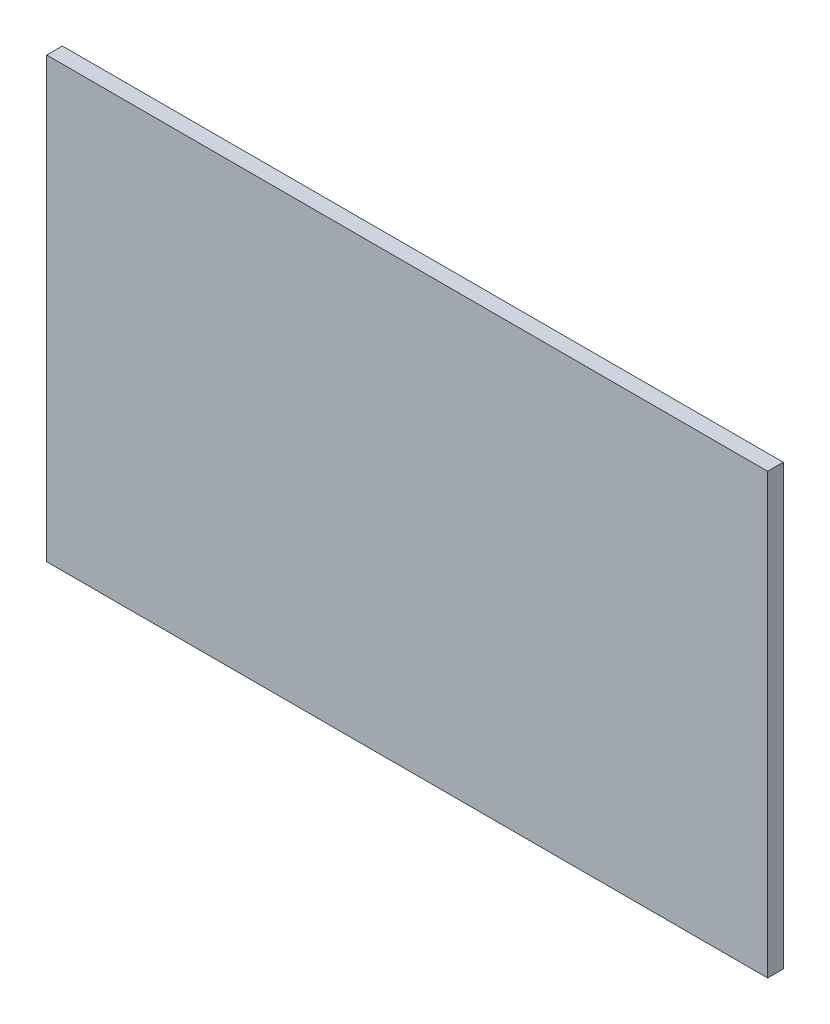
ISO-10303-21;
HEADER;
FILE_DESCRIPTION(('STEP AP214'),'2;1');
FILE_NAME('part.step','',(''),(''),'','','');
FILE_SCHEMA(('AUTOMOTIVE_DESIGN { 1 0 10303 214 1 1 1 1 }'));
ENDSEC;
DATA;
#1=APPLICATION_CONTEXT('core data for automotive mechanical design processes');
#2=APPLICATION_PROTOCOL_DEFINITION('international standard','automotive_design',2000,#1);
#3=PRODUCT_CONTEXT('',#1,'mechanical');
#4=PRODUCT('Part','Part','',(#3));
#5=PRODUCT_RELATED_PRODUCT_CATEGORY('part','',(#4));
#6=PRODUCT_DEFINITION_FORMATION('','',#4);
#7=PRODUCT_DEFINITION_CONTEXT('part definition',#1,'design');
#8=PRODUCT_DEFINITION('design','',#6,#7);
#9=PRODUCT_DEFINITION_SHAPE('','',#8);
#10=(LENGTH_UNIT() NAMED_UNIT(*) SI_UNIT(.MILLI.,.METRE.));
#11=(NAMED_UNIT(*) PLANE_ANGLE_UNIT() SI_UNIT($,.RADIAN.));
#12=(NAMED_UNIT(*) SI_UNIT($,.STERADIAN.) SOLID_ANGLE_UNIT());
#13=UNCERTAINTY_MEASURE_WITH_UNIT(LENGTH_MEASURE(1.E-05),#10,'distance_accuracy_value','');
#14=(GEOMETRIC_REPRESENTATION_CONTEXT(3) GLOBAL_UNCERTAINTY_ASSIGNED_CONTEXT((#13)) GLOBAL_UNIT_ASSIGNED_CONTEXT((#10,
#11,#12)) REPRESENTATION_CONTEXT('',''));
#15=CARTESIAN_POINT('',(0.,0.,0.));
#16=DIRECTION('',(0.,0.,1.));
#17=DIRECTION('',(1.,0.,0.));
#18=AXIS2_PLACEMENT_3D('',#15,#16,#17);
#19=CARTESIAN_POINT('',(-115.,70.,5.));
#20=DIRECTION('',(1.,0.,0.));
#21=DIRECTION('',(0.,0.,-1.));
#22=AXIS2_PLACEMENT_3D('',#19,#20,#21);
#23=PLANE('',#22);
#24=DIRECTION('',(0.,-1.,0.));
#25=VECTOR('',#24,1.);
#26=CARTESIAN_POINT('',(-115.,70.,0.));
#27=LINE('',#26,#25);
#28=CARTESIAN_POINT('',(-115.,70.,0.));
#29=VERTEX_POINT('',#28);
#30=CARTESIAN_POINT('',(-115.,-70.,0.));
#31=VERTEX_POINT('',#30);
#32=EDGE_CURVE('E98',#29,#31,#27,.T.);
#33=ORIENTED_EDGE('',*,*,#32,.T.);
#34=DIRECTION('',(0.,0.,-1.));
#35=VECTOR('',#34,1.);
#36=CARTESIAN_POINT('',(-115.,-70.,5.));
#37=LINE('',#36,#35);
#38=CARTESIAN_POINT('',(-115.,-70.,5.));
#39=VERTEX_POINT('',#38);
#40=EDGE_CURVE('E11',#39,#31,#37,.T.);
#41=ORIENTED_EDGE('',*,*,#40,.F.);
#42=DIRECTION('',(0.,-1.,0.));
#43=VECTOR('',#42,1.);
#44=CARTESIAN_POINT('',(-115.,70.,5.));
#45=LINE('',#44,#43);
#46=CARTESIAN_POINT('',(-115.,70.,5.));
#47=VERTEX_POINT('',#46);
#48=EDGE_CURVE('E86',#47,#39,#45,.T.);
#49=ORIENTED_EDGE('',*,*,#48,.F.);
#50=DIRECTION('',(0.,0.,-1.));
#51=VECTOR('',#50,1.);
#52=CARTESIAN_POINT('',(-115.,70.,5.));
#53=LINE('',#52,#51);
#54=EDGE_CURVE('E94',#47,#29,#53,.T.);
#55=ORIENTED_EDGE('',*,*,#54,.T.);
#56=EDGE_LOOP('',(#33,#41,#49,#55));
#57=FACE_BOUND('',#56,.T.);
#58=ADVANCED_FACE('F35',(#57),#23,.F.);
#59=CARTESIAN_POINT('',(-115.,-70.,5.));
#60=DIRECTION('',(0.,1.,0.));
#61=DIRECTION('',(0.,0.,1.));
#62=AXIS2_PLACEMENT_3D('',#59,#60,#61);
#63=PLANE('',#62);
#64=DIRECTION('',(1.,0.,0.));
#65=VECTOR('',#64,1.);
#66=CARTESIAN_POINT('',(-115.,-70.,0.));
#67=LINE('',#66,#65);
#68=CARTESIAN_POINT('',(115.,-70.,0.));
#69=VERTEX_POINT('',#68);
#70=EDGE_CURVE('E90',#31,#69,#67,.T.);
#71=ORIENTED_EDGE('',*,*,#70,.T.);
#72=DIRECTION('',(0.,0.,-1.));
#73=VECTOR('',#72,1.);
#74=CARTESIAN_POINT('',(115.,-70.,5.));
#75=LINE('',#74,#73);
#76=CARTESIAN_POINT('',(115.,-70.,5.));
#77=VERTEX_POINT('',#76);
#78=EDGE_CURVE('E43',#77,#69,#75,.T.);
#79=ORIENTED_EDGE('',*,*,#78,.F.);
#80=DIRECTION('',(1.,0.,0.));
#81=VECTOR('',#80,1.);
#82=CARTESIAN_POINT('',(-115.,-70.,5.));
#83=LINE('',#82,#81);
#84=EDGE_CURVE('E81',#39,#77,#83,.T.);
#85=ORIENTED_EDGE('',*,*,#84,.F.);
#86=ORIENTED_EDGE('',*,*,#40,.T.);
#87=EDGE_LOOP('',(#71,#79,#85,#86));
#88=FACE_BOUND('',#87,.T.);
#89=ADVANCED_FACE('F89',(#88),#63,.F.);
#90=CARTESIAN_POINT('',(115.,70.,5.));
#91=DIRECTION('',(-1.,0.,0.));
#92=DIRECTION('',(0.,-1.,0.));
#93=AXIS2_PLACEMENT_3D('',#90,#91,#92);
#94=PLANE('',#93);
#95=DIRECTION('',(0.,1.,0.));
#96=VECTOR('',#95,1.);
#97=CARTESIAN_POINT('',(115.,70.,0.));
#98=LINE('',#97,#96);
#99=CARTESIAN_POINT('',(115.,70.,0.));
#100=VERTEX_POINT('',#99);
#101=EDGE_CURVE('E68',#69,#100,#98,.T.);
#102=ORIENTED_EDGE('',*,*,#101,.T.);
#103=DIRECTION('',(0.,0.,-1.));
#104=VECTOR('',#103,1.);
#105=CARTESIAN_POINT('',(115.,70.,5.));
#106=LINE('',#105,#104);
#107=CARTESIAN_POINT('',(115.,70.,5.));
#108=VERTEX_POINT('',#107);
#109=EDGE_CURVE('E91',#108,#100,#106,.T.);
#110=ORIENTED_EDGE('',*,*,#109,.F.);
#111=DIRECTION('',(0.,1.,0.));
#112=VECTOR('',#111,1.);
#113=CARTESIAN_POINT('',(115.,70.,5.));
#114=LINE('',#113,#112);
#115=EDGE_CURVE('E84',#77,#108,#114,.T.);
#116=ORIENTED_EDGE('',*,*,#115,.F.);
#117=ORIENTED_EDGE('',*,*,#78,.T.);
#118=EDGE_LOOP('',(#102,#110,#116,#117));
#119=FACE_BOUND('',#118,.T.);
#120=ADVANCED_FACE('F92',(#119),#94,.F.);
#121=CARTESIAN_POINT('',(-115.,70.,5.));
#122=DIRECTION('',(0.,-1.,0.));
#123=DIRECTION('',(1.,0.,0.));
#124=AXIS2_PLACEMENT_3D('',#121,#122,#123);
#125=PLANE('',#124);
#126=DIRECTION('',(-1.,0.,0.));
#127=VECTOR('',#126,1.);
#128=CARTESIAN_POINT('',(-115.,70.,0.));
#129=LINE('',#128,#127);
#130=EDGE_CURVE('E74',#100,#29,#129,.T.);
#131=ORIENTED_EDGE('',*,*,#130,.T.);
#132=ORIENTED_EDGE('',*,*,#54,.F.);
#133=DIRECTION('',(-1.,0.,0.));
#134=VECTOR('',#133,1.);
#135=CARTESIAN_POINT('',(-115.,70.,5.));
#136=LINE('',#135,#134);
#137=EDGE_CURVE('E51',#108,#47,#136,.T.);
#138=ORIENTED_EDGE('',*,*,#137,.F.);
#139=ORIENTED_EDGE('',*,*,#109,.T.);
#140=EDGE_LOOP('',(#131,#132,#138,#139));
#141=FACE_BOUND('',#140,.T.);
#142=ADVANCED_FACE('F105',(#141),#125,.F.);
#143=CARTESIAN_POINT('',(0.,0.,5.));
#144=DIRECTION('',(0.,0.,1.));
#145=DIRECTION('',(1.,0.,0.));
#146=AXIS2_PLACEMENT_3D('',#143,#144,#145);
#147=PLANE('',#146);
#148=ORIENTED_EDGE('',*,*,#48,.T.);
#149=ORIENTED_EDGE('',*,*,#84,.T.);
#150=ORIENTED_EDGE('',*,*,#115,.T.);
#151=ORIENTED_EDGE('',*,*,#137,.T.);
#152=EDGE_LOOP('',(#148,#149,#150,#151));
#153=FACE_BOUND('',#152,.T.);
#154=ADVANCED_FACE('F82',(#153),#147,.T.);
#155=CARTESIAN_POINT('',(0.,0.,0.));
#156=DIRECTION('',(0.,0.,1.));
#157=DIRECTION('',(1.,0.,0.));
#158=AXIS2_PLACEMENT_3D('',#155,#156,#157);
#159=PLANE('',#158);
#160=ORIENTED_EDGE('',*,*,#32,.F.);
#161=ORIENTED_EDGE('',*,*,#130,.F.);
#162=ORIENTED_EDGE('',*,*,#101,.F.);
#163=ORIENTED_EDGE('',*,*,#70,.F.);
#164=EDGE_LOOP('',(#160,#161,#162,#163));
#165=FACE_BOUND('',#164,.T.);
#166=ADVANCED_FACE('F108',(#165),#159,.F.);
#167=CLOSED_SHELL('',(#58,#89,#120,#142,#154,#166));
#168=MANIFOLD_SOLID_BREP('B2',#167);
#169=ADVANCED_BREP_SHAPE_REPRESENTATION('',(#18,#168),#14);
#170=SHAPE_DEFINITION_REPRESENTATION(#9,#169);
ENDSEC;
END-ISO-10303-21;
